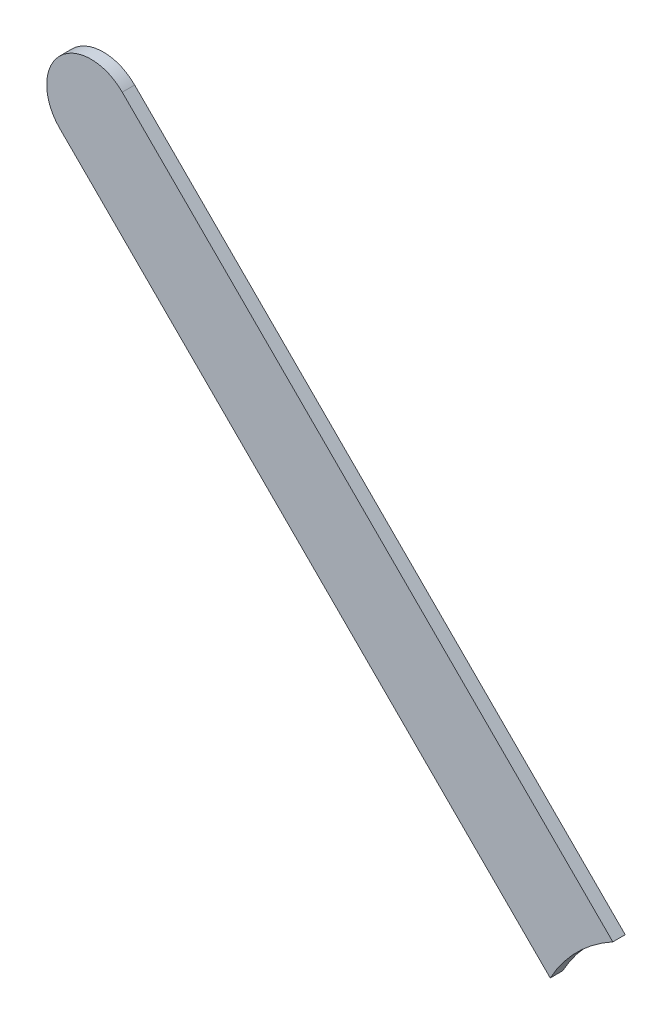
ISO-10303-21;
HEADER;
FILE_DESCRIPTION(('STEP AP214'),'2;1');
FILE_NAME('part.step','',(''),(''),'','','');
FILE_SCHEMA(('AUTOMOTIVE_DESIGN { 1 0 10303 214 1 1 1 1 }'));
ENDSEC;
DATA;
#1=APPLICATION_CONTEXT('core data for automotive mechanical design processes');
#2=APPLICATION_PROTOCOL_DEFINITION('international standard','automotive_design',2000,#1);
#3=PRODUCT_CONTEXT('',#1,'mechanical');
#4=PRODUCT('Part','Part','',(#3));
#5=PRODUCT_RELATED_PRODUCT_CATEGORY('part','',(#4));
#6=PRODUCT_DEFINITION_FORMATION('','',#4);
#7=PRODUCT_DEFINITION_CONTEXT('part definition',#1,'design');
#8=PRODUCT_DEFINITION('design','',#6,#7);
#9=PRODUCT_DEFINITION_SHAPE('','',#8);
#10=(LENGTH_UNIT() NAMED_UNIT(*) SI_UNIT(.MILLI.,.METRE.));
#11=(NAMED_UNIT(*) PLANE_ANGLE_UNIT() SI_UNIT($,.RADIAN.));
#12=(NAMED_UNIT(*) SI_UNIT($,.STERADIAN.) SOLID_ANGLE_UNIT());
#13=UNCERTAINTY_MEASURE_WITH_UNIT(LENGTH_MEASURE(1.E-05),#10,'distance_accuracy_value','');
#14=(GEOMETRIC_REPRESENTATION_CONTEXT(3) GLOBAL_UNCERTAINTY_ASSIGNED_CONTEXT((#13)) GLOBAL_UNIT_ASSIGNED_CONTEXT((#10,
#11,#12)) REPRESENTATION_CONTEXT('',''));
#15=CARTESIAN_POINT('',(0.,0.,0.));
#16=DIRECTION('',(0.,0.,1.));
#17=DIRECTION('',(1.,0.,0.));
#18=AXIS2_PLACEMENT_3D('',#15,#16,#17);
#19=CARTESIAN_POINT('',(82.0082434,94.19717,0.));
#20=DIRECTION('',(0.707106781186551,0.707106781186545,0.));
#21=DIRECTION('',(0.707106781186545,-0.707106781186551,0.));
#22=AXIS2_PLACEMENT_3D('',#19,#20,#21);
#23=PLANE('',#22);
#24=DIRECTION('',(0.707106781186545,-0.707106781186551,0.));
#25=VECTOR('',#24,1.);
#26=CARTESIAN_POINT('',(82.0082434,94.19717,0.03556));
#27=LINE('',#26,#25);
#28=CARTESIAN_POINT('',(82.0082434,94.19717,0.03556));
#29=VERTEX_POINT('',#28);
#30=CARTESIAN_POINT('',(83.4159441086503,92.7894692913497,0.03556));
#31=VERTEX_POINT('',#30);
#32=EDGE_CURVE('E11',#29,#31,#27,.T.);
#33=ORIENTED_EDGE('',*,*,#32,.F.);
#34=DIRECTION('',(0.,0.,1.));
#35=VECTOR('',#34,1.);
#36=CARTESIAN_POINT('',(82.0082434,94.19717,0.));
#37=LINE('',#36,#35);
#38=CARTESIAN_POINT('',(82.0082434,94.19717,0.));
#39=VERTEX_POINT('',#38);
#40=EDGE_CURVE('E24',#39,#29,#37,.T.);
#41=ORIENTED_EDGE('',*,*,#40,.F.);
#42=DIRECTION('',(0.707106781186545,-0.707106781186551,0.));
#43=VECTOR('',#42,1.);
#44=CARTESIAN_POINT('',(82.0082434,94.19717,0.));
#45=LINE('',#44,#43);
#46=CARTESIAN_POINT('',(83.4159441086503,92.7894692913497,0.));
#47=VERTEX_POINT('',#46);
#48=EDGE_CURVE('E75',#39,#47,#45,.T.);
#49=ORIENTED_EDGE('',*,*,#48,.T.);
#50=DIRECTION('',(0.,0.,1.));
#51=VECTOR('',#50,1.);
#52=CARTESIAN_POINT('',(83.4159441086503,92.7894692913497,0.));
#53=LINE('',#52,#51);
#54=EDGE_CURVE('E37',#47,#31,#53,.T.);
#55=ORIENTED_EDGE('',*,*,#54,.T.);
#56=EDGE_LOOP('',(#33,#41,#49,#55));
#57=FACE_BOUND('',#56,.T.);
#58=ADVANCED_FACE('F17',(#57),#23,.F.);
#59=CARTESIAN_POINT('',(83.8110084,92.5740084,0.));
#60=DIRECTION('',(0.,0.,-1.));
#61=DIRECTION('',(1.,0.,0.));
#62=AXIS2_PLACEMENT_3D('',#59,#60,#61);
#63=CYLINDRICAL_SURFACE('',#62,0.4499991);
#64=DIRECTION('',(0.,0.,1.));
#65=VECTOR('',#64,1.);
#66=CARTESIAN_POINT('',(83.5955491522599,92.9690735877401,0.));
#67=LINE('',#66,#65);
#68=CARTESIAN_POINT('',(83.5955491522599,92.9690735877401,0.));
#69=VERTEX_POINT('',#68);
#70=CARTESIAN_POINT('',(83.5955491522599,92.9690735877401,0.03556));
#71=VERTEX_POINT('',#70);
#72=EDGE_CURVE('E67',#69,#71,#67,.T.);
#73=ORIENTED_EDGE('',*,*,#72,.T.);
#74=CARTESIAN_POINT('',(83.8110084,92.5740084,0.03556));
#75=DIRECTION('',(0.,0.,1.));
#76=DIRECTION('',(1.,0.,0.));
#77=AXIS2_PLACEMENT_3D('',#74,#75,#76);
#78=CIRCLE('',#77,0.4499991);
#79=EDGE_CURVE('E82',#71,#31,#78,.T.);
#80=ORIENTED_EDGE('',*,*,#79,.T.);
#81=ORIENTED_EDGE('',*,*,#54,.F.);
#82=CARTESIAN_POINT('',(83.8110084,92.5740084,0.));
#83=DIRECTION('',(0.,0.,1.));
#84=DIRECTION('',(1.,0.,0.));
#85=AXIS2_PLACEMENT_3D('',#82,#83,#84);
#86=CIRCLE('',#85,0.4499991);
#87=EDGE_CURVE('E80',#69,#47,#86,.T.);
#88=ORIENTED_EDGE('',*,*,#87,.F.);
#89=EDGE_LOOP('',(#73,#80,#81,#88));
#90=FACE_BOUND('',#89,.T.);
#91=ADVANCED_FACE('F88',(#90),#63,.F.);
#92=CARTESIAN_POINT('',(83.5955491522599,92.9690735877401,0.));
#93=DIRECTION('',(-0.707106781186548,-0.707106781186548,0.));
#94=DIRECTION('',(-0.707106781186548,0.707106781186548,0.));
#95=AXIS2_PLACEMENT_3D('',#92,#93,#94);
#96=PLANE('',#95);
#97=DIRECTION('',(-0.707106781186548,0.707106781186548,0.));
#98=VECTOR('',#97,1.);
#99=CARTESIAN_POINT('',(83.9008101,92.66381264,0.03556));
#100=LINE('',#99,#98);
#101=CARTESIAN_POINT('',(82.18784934,94.3767734,0.03556));
#102=VERTEX_POINT('',#101);
#103=EDGE_CURVE('E71',#71,#102,#100,.T.);
#104=ORIENTED_EDGE('',*,*,#103,.F.);
#105=ORIENTED_EDGE('',*,*,#72,.F.);
#106=DIRECTION('',(-0.707106781186548,0.707106781186548,0.));
#107=VECTOR('',#106,1.);
#108=CARTESIAN_POINT('',(83.9008101,92.66381264,0.));
#109=LINE('',#108,#107);
#110=CARTESIAN_POINT('',(82.18784934,94.3767734,0.));
#111=VERTEX_POINT('',#110);
#112=EDGE_CURVE('E63',#69,#111,#109,.T.);
#113=ORIENTED_EDGE('',*,*,#112,.T.);
#114=DIRECTION('',(0.,0.,1.));
#115=VECTOR('',#114,1.);
#116=CARTESIAN_POINT('',(82.18784934,94.3767734,0.));
#117=LINE('',#116,#115);
#118=EDGE_CURVE('E53',#111,#102,#117,.T.);
#119=ORIENTED_EDGE('',*,*,#118,.T.);
#120=EDGE_LOOP('',(#104,#105,#113,#119));
#121=FACE_BOUND('',#120,.T.);
#122=ADVANCED_FACE('F66',(#121),#96,.F.);
#123=CARTESIAN_POINT('',(82.09804637,94.2869717,0.));
#124=DIRECTION('',(0.,0.,-1.));
#125=DIRECTION('',(0.707111781181459,0.707101781156281,0.));
#126=AXIS2_PLACEMENT_3D('',#123,#124,#125);
#127=CYLINDRICAL_SURFACE('',#126,0.126999680092939);
#128=CARTESIAN_POINT('',(82.09804637,94.2869717,0.03556));
#129=DIRECTION('',(0.,0.,1.));
#130=DIRECTION('',(0.707111781181459,0.707101781156281,0.));
#131=AXIS2_PLACEMENT_3D('',#128,#129,#130);
#132=CIRCLE('',#131,0.126999680092939);
#133=EDGE_CURVE('E59',#102,#29,#132,.T.);
#134=ORIENTED_EDGE('',*,*,#133,.F.);
#135=ORIENTED_EDGE('',*,*,#118,.F.);
#136=CARTESIAN_POINT('',(82.09804637,94.2869717,0.));
#137=DIRECTION('',(0.,0.,1.));
#138=DIRECTION('',(0.707111781181459,0.707101781156281,0.));
#139=AXIS2_PLACEMENT_3D('',#136,#137,#138);
#140=CIRCLE('',#139,0.126999680092939);
#141=EDGE_CURVE('E57',#111,#39,#140,.T.);
#142=ORIENTED_EDGE('',*,*,#141,.T.);
#143=ORIENTED_EDGE('',*,*,#40,.T.);
#144=EDGE_LOOP('',(#134,#135,#142,#143));
#145=FACE_BOUND('',#144,.T.);
#146=ADVANCED_FACE('F55',(#145),#127,.T.);
#147=CARTESIAN_POINT('',(82.0082434,94.19717,0.));
#148=DIRECTION('',(0.,0.,-1.));
#149=DIRECTION('',(-1.,0.,0.));
#150=AXIS2_PLACEMENT_3D('',#147,#148,#149);
#151=PLANE('',#150);
#152=ORIENTED_EDGE('',*,*,#48,.F.);
#153=ORIENTED_EDGE('',*,*,#141,.F.);
#154=ORIENTED_EDGE('',*,*,#112,.F.);
#155=ORIENTED_EDGE('',*,*,#87,.T.);
#156=EDGE_LOOP('',(#152,#153,#154,#155));
#157=FACE_BOUND('',#156,.T.);
#158=ADVANCED_FACE('F74',(#157),#151,.T.);
#159=CARTESIAN_POINT('',(82.0082434,94.19717,0.03556));
#160=DIRECTION('',(0.,0.,-1.));
#161=DIRECTION('',(-1.,0.,0.));
#162=AXIS2_PLACEMENT_3D('',#159,#160,#161);
#163=PLANE('',#162);
#164=ORIENTED_EDGE('',*,*,#133,.T.);
#165=ORIENTED_EDGE('',*,*,#32,.T.);
#166=ORIENTED_EDGE('',*,*,#79,.F.);
#167=ORIENTED_EDGE('',*,*,#103,.T.);
#168=EDGE_LOOP('',(#164,#165,#166,#167));
#169=FACE_BOUND('',#168,.T.);
#170=ADVANCED_FACE('F91',(#169),#163,.F.);
#171=CLOSED_SHELL('',(#58,#91,#122,#146,#158,#170));
#172=MANIFOLD_SOLID_BREP('B1',#171);
#173=ADVANCED_BREP_SHAPE_REPRESENTATION('',(#18,#172),#14);
#174=SHAPE_DEFINITION_REPRESENTATION(#9,#173);
ENDSEC;
END-ISO-10303-21;
